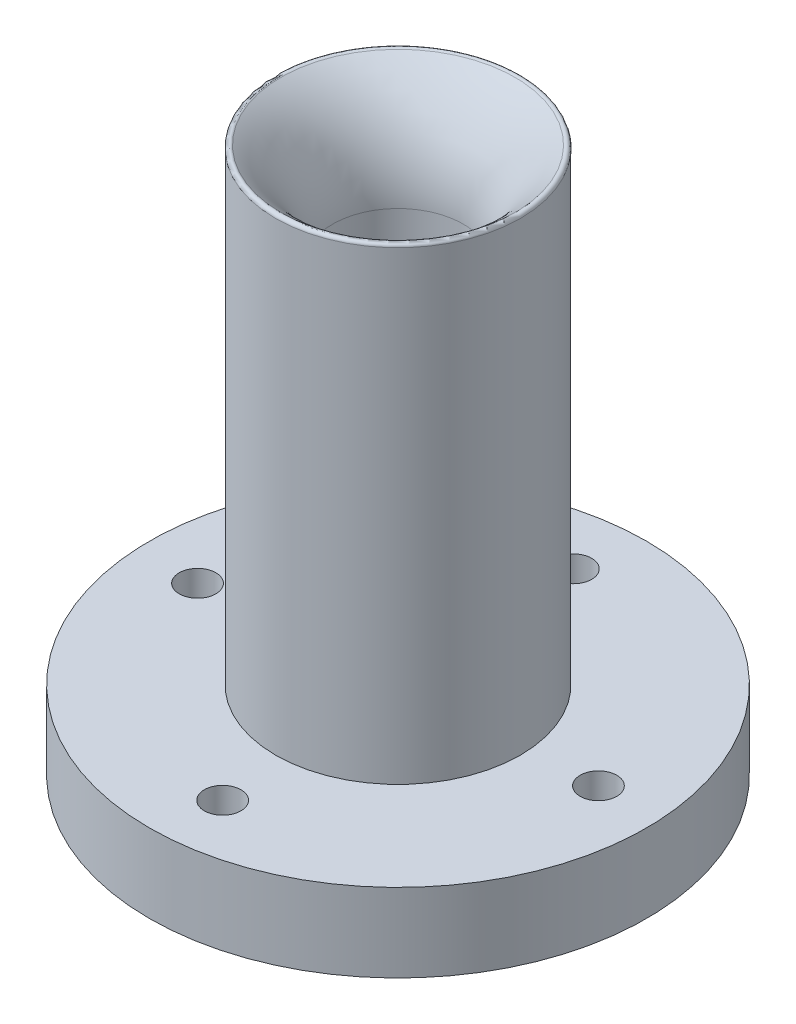
ISO-10303-21;
HEADER;
FILE_DESCRIPTION(('STEP AP214'),'2;1');
FILE_NAME('part.step','',(''),(''),'','','');
FILE_SCHEMA(('AUTOMOTIVE_DESIGN { 1 0 10303 214 1 1 1 1 }'));
ENDSEC;
DATA;
#1=APPLICATION_CONTEXT('core data for automotive mechanical design processes');
#2=APPLICATION_PROTOCOL_DEFINITION('international standard','automotive_design',2000,#1);
#3=PRODUCT_CONTEXT('',#1,'mechanical');
#4=PRODUCT('Part','Part','',(#3));
#5=PRODUCT_RELATED_PRODUCT_CATEGORY('part','',(#4));
#6=PRODUCT_DEFINITION_FORMATION('','',#4);
#7=PRODUCT_DEFINITION_CONTEXT('part definition',#1,'design');
#8=PRODUCT_DEFINITION('design','',#6,#7);
#9=PRODUCT_DEFINITION_SHAPE('','',#8);
#10=(LENGTH_UNIT() NAMED_UNIT(*) SI_UNIT(.MILLI.,.METRE.));
#11=(NAMED_UNIT(*) PLANE_ANGLE_UNIT() SI_UNIT($,.RADIAN.));
#12=(NAMED_UNIT(*) SI_UNIT($,.STERADIAN.) SOLID_ANGLE_UNIT());
#13=UNCERTAINTY_MEASURE_WITH_UNIT(LENGTH_MEASURE(1.E-05),#10,'distance_accuracy_value','');
#14=(GEOMETRIC_REPRESENTATION_CONTEXT(3) GLOBAL_UNCERTAINTY_ASSIGNED_CONTEXT((#13)) GLOBAL_UNIT_ASSIGNED_CONTEXT((#10,
#11,#12)) REPRESENTATION_CONTEXT('',''));
#15=CARTESIAN_POINT('',(0.,0.,0.));
#16=DIRECTION('',(0.,0.,1.));
#17=DIRECTION('',(1.,0.,0.));
#18=AXIS2_PLACEMENT_3D('',#15,#16,#17);
#19=CARTESIAN_POINT('',(17.4331967800399,-14.9725871002928,0.));
#20=DIRECTION('',(0.,1.,0.));
#21=DIRECTION('',(0.,0.,1.));
#22=AXIS2_PLACEMENT_3D('',#19,#20,#21);
#23=PLANE('',#22);
#24=CARTESIAN_POINT('',(35.9200833269069,-14.9725871002928,-2.39741815044188));
#25=DIRECTION('',(0.,1.,0.));
#26=DIRECTION('',(0.,0.,1.));
#27=AXIS2_PLACEMENT_3D('',#24,#25,#26);
#28=CIRCLE('',#27,3.5);
#29=CARTESIAN_POINT('',(35.9200833269069,-14.9725871002928,1.10258184955812));
#30=VERTEX_POINT('',#29);
#31=EDGE_CURVE('E85',#30,#30,#28,.T.);
#32=ORIENTED_EDGE('',*,*,#31,.T.);
#33=EDGE_LOOP('',(#32));
#34=FACE_BOUND('',#33,.T.);
#35=CARTESIAN_POINT('',(2.39741815044188,-14.9725871002928,35.9200833269069));
#36=DIRECTION('',(0.,1.,0.));
#37=DIRECTION('',(0.,0.,1.));
#38=AXIS2_PLACEMENT_3D('',#35,#36,#37);
#39=CIRCLE('',#38,3.5);
#40=CARTESIAN_POINT('',(2.39741815044188,-14.9725871002928,39.4200833269069));
#41=VERTEX_POINT('',#40);
#42=EDGE_CURVE('E79',#41,#41,#39,.T.);
#43=ORIENTED_EDGE('',*,*,#42,.T.);
#44=EDGE_LOOP('',(#43));
#45=FACE_BOUND('',#44,.T.);
#46=CARTESIAN_POINT('',(-35.9200833269069,-14.9725871002928,2.39741815044188));
#47=DIRECTION('',(0.,1.,0.));
#48=DIRECTION('',(0.,0.,1.));
#49=AXIS2_PLACEMENT_3D('',#46,#47,#48);
#50=CIRCLE('',#49,3.5);
#51=CARTESIAN_POINT('',(-35.9200833269069,-14.9725871002928,5.89741815044188));
#52=VERTEX_POINT('',#51);
#53=EDGE_CURVE('E73',#52,#52,#50,.T.);
#54=ORIENTED_EDGE('',*,*,#53,.T.);
#55=EDGE_LOOP('',(#54));
#56=FACE_BOUND('',#55,.T.);
#57=CARTESIAN_POINT('',(-2.39741815044188,-14.9725871002928,-35.9200833269069));
#58=DIRECTION('',(0.,1.,0.));
#59=DIRECTION('',(0.,0.,1.));
#60=AXIS2_PLACEMENT_3D('',#57,#58,#59);
#61=CIRCLE('',#60,3.5);
#62=CARTESIAN_POINT('',(-2.39741815044188,-14.9725871002928,-32.4200833269069));
#63=VERTEX_POINT('',#62);
#64=EDGE_CURVE('E67',#63,#63,#61,.T.);
#65=ORIENTED_EDGE('',*,*,#64,.T.);
#66=EDGE_LOOP('',(#65));
#67=FACE_BOUND('',#66,.T.);
#68=CARTESIAN_POINT('',(0.,-14.9725871002928,0.));
#69=DIRECTION('',(0.,1.,0.));
#70=DIRECTION('',(0.,0.,1.));
#71=AXIS2_PLACEMENT_3D('',#68,#69,#70);
#72=CIRCLE('',#71,47.5);
#73=CARTESIAN_POINT('',(0.,-14.9725871002928,47.5));
#74=VERTEX_POINT('',#73);
#75=EDGE_CURVE('E10',#74,#74,#72,.T.);
#76=ORIENTED_EDGE('',*,*,#75,.F.);
#77=EDGE_LOOP('',(#76));
#78=FACE_BOUND('',#77,.T.);
#79=ADVANCED_FACE('F35',(#34,#45,#56,#67,#78),#23,.F.);
#80=CARTESIAN_POINT('',(0.,0.,0.));
#81=DIRECTION('',(0.,1.,0.));
#82=DIRECTION('',(0.,0.,1.));
#83=AXIS2_PLACEMENT_3D('',#80,#81,#82);
#84=CYLINDRICAL_SURFACE('',#83,47.5);
#85=CARTESIAN_POINT('',(0.,0.0274128997071882,0.));
#86=DIRECTION('',(0.,1.,0.));
#87=DIRECTION('',(0.,0.,1.));
#88=AXIS2_PLACEMENT_3D('',#85,#86,#87);
#89=CIRCLE('',#88,47.5);
#90=CARTESIAN_POINT('',(0.,0.0274128997071882,47.5));
#91=VERTEX_POINT('',#90);
#92=EDGE_CURVE('E41',#91,#91,#89,.T.);
#93=ORIENTED_EDGE('',*,*,#92,.F.);
#94=EDGE_LOOP('',(#93));
#95=FACE_BOUND('',#94,.T.);
#96=ORIENTED_EDGE('',*,*,#75,.T.);
#97=EDGE_LOOP('',(#96));
#98=FACE_BOUND('',#97,.T.);
#99=ADVANCED_FACE('F99',(#95,#98),#84,.T.);
#100=CARTESIAN_POINT('',(23.3920750868037,0.0274128997071882,0.));
#101=DIRECTION('',(0.,-1.,0.));
#102=DIRECTION('',(0.,0.,-1.));
#103=AXIS2_PLACEMENT_3D('',#100,#101,#102);
#104=PLANE('',#103);
#105=CARTESIAN_POINT('',(35.9200833269069,0.0274128997071926,-2.39741815044188));
#106=DIRECTION('',(0.,1.,0.));
#107=DIRECTION('',(-1.,0.,0.));
#108=AXIS2_PLACEMENT_3D('',#105,#106,#107);
#109=CIRCLE('',#108,3.5);
#110=CARTESIAN_POINT('',(32.4200833269069,0.0274128997071922,-2.39741815044188));
#111=VERTEX_POINT('',#110);
#112=EDGE_CURVE('E88',#111,#111,#109,.T.);
#113=ORIENTED_EDGE('',*,*,#112,.F.);
#114=EDGE_LOOP('',(#113));
#115=FACE_BOUND('',#114,.T.);
#116=CARTESIAN_POINT('',(2.39741815044188,0.0274128997071885,35.9200833269069));
#117=DIRECTION('',(0.,1.,0.));
#118=DIRECTION('',(-1.,0.,0.));
#119=AXIS2_PLACEMENT_3D('',#116,#117,#118);
#120=CIRCLE('',#119,3.5);
#121=CARTESIAN_POINT('',(-1.10258184955812,0.0274128997071881,35.9200833269069));
#122=VERTEX_POINT('',#121);
#123=EDGE_CURVE('E82',#122,#122,#120,.T.);
#124=ORIENTED_EDGE('',*,*,#123,.F.);
#125=EDGE_LOOP('',(#124));
#126=FACE_BOUND('',#125,.T.);
#127=CARTESIAN_POINT('',(-35.9200833269069,0.0274128997071838,2.39741815044188));
#128=DIRECTION('',(0.,1.,0.));
#129=DIRECTION('',(-1.,0.,0.));
#130=AXIS2_PLACEMENT_3D('',#127,#128,#129);
#131=CIRCLE('',#130,3.5);
#132=CARTESIAN_POINT('',(-39.4200833269069,0.0274128997071834,2.39741815044188));
#133=VERTEX_POINT('',#132);
#134=EDGE_CURVE('E76',#133,#133,#131,.T.);
#135=ORIENTED_EDGE('',*,*,#134,.F.);
#136=EDGE_LOOP('',(#135));
#137=FACE_BOUND('',#136,.T.);
#138=CARTESIAN_POINT('',(-2.39741815044188,0.0274128997071879,-35.9200833269069));
#139=DIRECTION('',(0.,1.,0.));
#140=DIRECTION('',(-1.,0.,0.));
#141=AXIS2_PLACEMENT_3D('',#138,#139,#140);
#142=CIRCLE('',#141,3.5);
#143=CARTESIAN_POINT('',(-5.89741815044188,0.0274128997071875,-35.9200833269069));
#144=VERTEX_POINT('',#143);
#145=EDGE_CURVE('E70',#144,#144,#142,.T.);
#146=ORIENTED_EDGE('',*,*,#145,.F.);
#147=EDGE_LOOP('',(#146));
#148=FACE_BOUND('',#147,.T.);
#149=CARTESIAN_POINT('',(0.,0.0274128997071882,0.));
#150=DIRECTION('',(0.,1.,0.));
#151=DIRECTION('',(0.,0.,1.));
#152=AXIS2_PLACEMENT_3D('',#149,#150,#151);
#153=CIRCLE('',#152,23.3920750868037);
#154=CARTESIAN_POINT('',(0.,0.0274128997071882,23.3920750868037));
#155=VERTEX_POINT('',#154);
#156=EDGE_CURVE('E46',#155,#155,#153,.T.);
#157=ORIENTED_EDGE('',*,*,#156,.F.);
#158=EDGE_LOOP('',(#157));
#159=FACE_BOUND('',#158,.T.);
#160=ORIENTED_EDGE('',*,*,#92,.T.);
#161=EDGE_LOOP('',(#160));
#162=FACE_BOUND('',#161,.T.);
#163=ADVANCED_FACE('F95',(#115,#126,#137,#148,#159,#162),#104,.F.);
#164=CARTESIAN_POINT('',(0.,0.,0.));
#165=DIRECTION('',(0.,1.,0.));
#166=DIRECTION('',(0.,0.,1.));
#167=AXIS2_PLACEMENT_3D('',#164,#165,#166);
#168=CYLINDRICAL_SURFACE('',#167,23.3920750868037);
#169=CARTESIAN_POINT('',(0.,88.8749317475143,0.));
#170=DIRECTION('',(0.,1.,0.));
#171=DIRECTION('',(0.,0.,1.));
#172=AXIS2_PLACEMENT_3D('',#169,#170,#171);
#173=CIRCLE('',#172,23.3920750868037);
#174=CARTESIAN_POINT('',(0.,88.8749317475143,23.3920750868037));
#175=VERTEX_POINT('',#174);
#176=EDGE_CURVE('E52',#175,#175,#173,.T.);
#177=ORIENTED_EDGE('',*,*,#176,.F.);
#178=EDGE_LOOP('',(#177));
#179=FACE_BOUND('',#178,.T.);
#180=ORIENTED_EDGE('',*,*,#156,.T.);
#181=EDGE_LOOP('',(#180));
#182=FACE_BOUND('',#181,.T.);
#183=ADVANCED_FACE('F98',(#179,#182),#168,.T.);
#184=CARTESIAN_POINT('',(0.,88.8749317475143,0.));
#185=DIRECTION('',(0.,1.,0.));
#186=DIRECTION('',(0.,0.,1.));
#187=AXIS2_PLACEMENT_3D('',#184,#185,#186);
#188=TOROIDAL_SURFACE('',#187,22.7683639906616,0.623711096142129);
#189=CARTESIAN_POINT('',(0.,89.3642411454899,0.));
#190=DIRECTION('',(0.,1.,0.));
#191=DIRECTION('',(0.,0.,1.));
#192=AXIS2_PLACEMENT_3D('',#189,#190,#191);
#193=CIRCLE('',#192,22.3815929414561);
#194=CARTESIAN_POINT('',(0.,89.3642411454899,22.3815929414561));
#195=VERTEX_POINT('',#194);
#196=EDGE_CURVE('E57',#195,#195,#193,.T.);
#197=ORIENTED_EDGE('',*,*,#196,.F.);
#198=EDGE_LOOP('',(#197));
#199=FACE_BOUND('',#198,.T.);
#200=ORIENTED_EDGE('',*,*,#176,.T.);
#201=EDGE_LOOP('',(#200));
#202=FACE_BOUND('',#201,.T.);
#203=ADVANCED_FACE('F110',(#199,#202),#188,.T.);
#204=CARTESIAN_POINT('',(0.,70.,0.));
#205=DIRECTION('',(0.,1.,0.));
#206=DIRECTION('',(0.,0.,1.));
#207=AXIS2_PLACEMENT_3D('',#204,#205,#206);
#208=TOROIDAL_SURFACE('',#207,36.4141460795529,23.9141460795529);
#209=CARTESIAN_POINT('',(0.,70.,0.));
#210=DIRECTION('',(0.,1.,0.));
#211=DIRECTION('',(0.,0.,1.));
#212=AXIS2_PLACEMENT_3D('',#209,#210,#211);
#213=CIRCLE('',#212,12.5);
#214=CARTESIAN_POINT('',(0.,70.,12.5));
#215=VERTEX_POINT('',#214);
#216=EDGE_CURVE('E60',#215,#215,#213,.T.);
#217=ORIENTED_EDGE('',*,*,#216,.F.);
#218=EDGE_LOOP('',(#217));
#219=FACE_BOUND('',#218,.T.);
#220=ORIENTED_EDGE('',*,*,#196,.T.);
#221=EDGE_LOOP('',(#220));
#222=FACE_BOUND('',#221,.T.);
#223=ADVANCED_FACE('F116',(#219,#222),#208,.T.);
#224=CARTESIAN_POINT('',(0.,0.,0.));
#225=DIRECTION('',(0.,1.,0.));
#226=DIRECTION('',(0.,0.,1.));
#227=AXIS2_PLACEMENT_3D('',#224,#225,#226);
#228=CYLINDRICAL_SURFACE('',#227,12.5);
#229=CARTESIAN_POINT('',(0.,0.,0.));
#230=DIRECTION('',(0.,1.,0.));
#231=DIRECTION('',(0.,0.,1.));
#232=AXIS2_PLACEMENT_3D('',#229,#230,#231);
#233=CIRCLE('',#232,12.5);
#234=CARTESIAN_POINT('',(0.,0.,12.5));
#235=VERTEX_POINT('',#234);
#236=EDGE_CURVE('E64',#235,#235,#233,.T.);
#237=ORIENTED_EDGE('',*,*,#236,.F.);
#238=EDGE_LOOP('',(#237));
#239=FACE_BOUND('',#238,.T.);
#240=ORIENTED_EDGE('',*,*,#216,.T.);
#241=EDGE_LOOP('',(#240));
#242=FACE_BOUND('',#241,.T.);
#243=ADVANCED_FACE('F148',(#239,#242),#228,.F.);
#244=CARTESIAN_POINT('',(0.,0.,0.));
#245=DIRECTION('',(0.,-1.,0.));
#246=DIRECTION('',(0.,0.,-1.));
#247=AXIS2_PLACEMENT_3D('',#244,#245,#246);
#248=PLANE('',#247);
#249=ORIENTED_EDGE('',*,*,#236,.T.);
#250=EDGE_LOOP('',(#249));
#251=FACE_BOUND('',#250,.T.);
#252=ADVANCED_FACE('F138',(#251),#248,.F.);
#253=CARTESIAN_POINT('',(-2.39741815044188,-19.9725871002928,-35.9200833269069));
#254=DIRECTION('',(0.,1.,0.));
#255=DIRECTION('',(-1.,0.,0.));
#256=AXIS2_PLACEMENT_3D('',#253,#254,#255);
#257=CYLINDRICAL_SURFACE('',#256,3.5);
#258=ORIENTED_EDGE('',*,*,#145,.T.);
#259=EDGE_LOOP('',(#258));
#260=FACE_BOUND('',#259,.T.);
#261=ORIENTED_EDGE('',*,*,#64,.F.);
#262=EDGE_LOOP('',(#261));
#263=FACE_BOUND('',#262,.T.);
#264=ADVANCED_FACE('F135',(#260,#263),#257,.F.);
#265=CARTESIAN_POINT('',(-35.9200833269069,-19.9725871002928,2.39741815044188));
#266=DIRECTION('',(0.,1.,0.));
#267=DIRECTION('',(-1.,0.,0.));
#268=AXIS2_PLACEMENT_3D('',#265,#266,#267);
#269=CYLINDRICAL_SURFACE('',#268,3.5);
#270=ORIENTED_EDGE('',*,*,#134,.T.);
#271=EDGE_LOOP('',(#270));
#272=FACE_BOUND('',#271,.T.);
#273=ORIENTED_EDGE('',*,*,#53,.F.);
#274=EDGE_LOOP('',(#273));
#275=FACE_BOUND('',#274,.T.);
#276=ADVANCED_FACE('F137',(#272,#275),#269,.F.);
#277=CARTESIAN_POINT('',(2.39741815044188,-19.9725871002928,35.9200833269069));
#278=DIRECTION('',(0.,1.,0.));
#279=DIRECTION('',(-1.,0.,0.));
#280=AXIS2_PLACEMENT_3D('',#277,#278,#279);
#281=CYLINDRICAL_SURFACE('',#280,3.5);
#282=ORIENTED_EDGE('',*,*,#123,.T.);
#283=EDGE_LOOP('',(#282));
#284=FACE_BOUND('',#283,.T.);
#285=ORIENTED_EDGE('',*,*,#42,.F.);
#286=EDGE_LOOP('',(#285));
#287=FACE_BOUND('',#286,.T.);
#288=ADVANCED_FACE('F145',(#284,#287),#281,.F.);
#289=CARTESIAN_POINT('',(35.9200833269069,-19.9725871002928,-2.39741815044188));
#290=DIRECTION('',(0.,1.,0.));
#291=DIRECTION('',(-1.,0.,0.));
#292=AXIS2_PLACEMENT_3D('',#289,#290,#291);
#293=CYLINDRICAL_SURFACE('',#292,3.5);
#294=ORIENTED_EDGE('',*,*,#112,.T.);
#295=EDGE_LOOP('',(#294));
#296=FACE_BOUND('',#295,.T.);
#297=ORIENTED_EDGE('',*,*,#31,.F.);
#298=EDGE_LOOP('',(#297));
#299=FACE_BOUND('',#298,.T.);
#300=ADVANCED_FACE('F92',(#296,#299),#293,.F.);
#301=CLOSED_SHELL('',(#79,#99,#163,#183,#203,#223,#243,#252,#264,#276,#288,#300));
#302=MANIFOLD_SOLID_BREP('B2',#301);
#303=ADVANCED_BREP_SHAPE_REPRESENTATION('',(#18,#302),#14);
#304=SHAPE_DEFINITION_REPRESENTATION(#9,#303);
ENDSEC;
END-ISO-10303-21;
